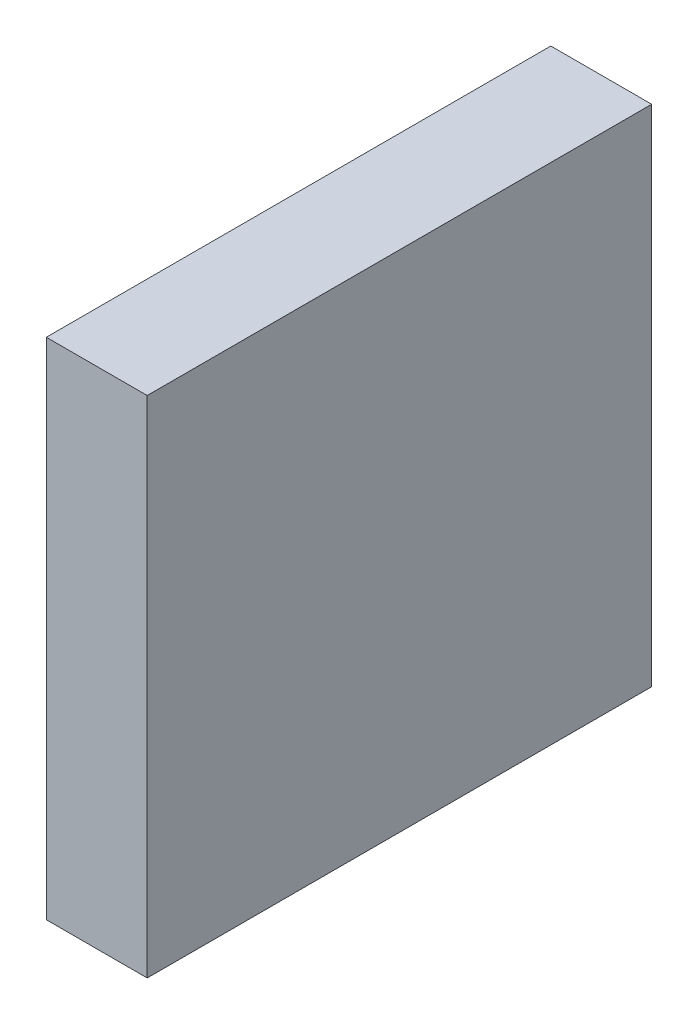
ISO-10303-21;
HEADER;
FILE_DESCRIPTION(('STEP AP214'),'2;1');
FILE_NAME('part.step','',(''),(''),'','','');
FILE_SCHEMA(('AUTOMOTIVE_DESIGN { 1 0 10303 214 1 1 1 1 }'));
ENDSEC;
DATA;
#1=APPLICATION_CONTEXT('core data for automotive mechanical design processes');
#2=APPLICATION_PROTOCOL_DEFINITION('international standard','automotive_design',2000,#1);
#3=PRODUCT_CONTEXT('',#1,'mechanical');
#4=PRODUCT('Part','Part','',(#3));
#5=PRODUCT_RELATED_PRODUCT_CATEGORY('part','',(#4));
#6=PRODUCT_DEFINITION_FORMATION('','',#4);
#7=PRODUCT_DEFINITION_CONTEXT('part definition',#1,'design');
#8=PRODUCT_DEFINITION('design','',#6,#7);
#9=PRODUCT_DEFINITION_SHAPE('','',#8);
#10=(LENGTH_UNIT() NAMED_UNIT(*) SI_UNIT(.MILLI.,.METRE.));
#11=(NAMED_UNIT(*) PLANE_ANGLE_UNIT() SI_UNIT($,.RADIAN.));
#12=(NAMED_UNIT(*) SI_UNIT($,.STERADIAN.) SOLID_ANGLE_UNIT());
#13=UNCERTAINTY_MEASURE_WITH_UNIT(LENGTH_MEASURE(1.E-05),#10,'distance_accuracy_value','');
#14=(GEOMETRIC_REPRESENTATION_CONTEXT(3) GLOBAL_UNCERTAINTY_ASSIGNED_CONTEXT((#13)) GLOBAL_UNIT_ASSIGNED_CONTEXT((#10,
#11,#12)) REPRESENTATION_CONTEXT('',''));
#15=CARTESIAN_POINT('',(0.,0.,0.));
#16=DIRECTION('',(0.,0.,1.));
#17=DIRECTION('',(1.,0.,0.));
#18=AXIS2_PLACEMENT_3D('',#15,#16,#17);
#19=CARTESIAN_POINT('',(-16.0310837576449,60.2513502285003,60.));
#20=DIRECTION('',(-1.,0.,0.));
#21=DIRECTION('',(0.,-1.,0.));
#22=AXIS2_PLACEMENT_3D('',#19,#20,#21);
#23=PLANE('',#22);
#24=DIRECTION('',(0.,1.,0.));
#25=VECTOR('',#24,1.);
#26=CARTESIAN_POINT('',(-16.0310837576449,60.2513502285003,0.));
#27=LINE('',#26,#25);
#28=CARTESIAN_POINT('',(-16.0310837576449,0.251350228500251,0.));
#29=VERTEX_POINT('',#28);
#30=CARTESIAN_POINT('',(-16.0310837576449,60.2513502285003,0.));
#31=VERTEX_POINT('',#30);
#32=EDGE_CURVE('E96',#29,#31,#27,.T.);
#33=ORIENTED_EDGE('',*,*,#32,.T.);
#34=DIRECTION('',(0.,0.,-1.));
#35=VECTOR('',#34,1.);
#36=CARTESIAN_POINT('',(-16.0310837576449,60.2513502285003,60.));
#37=LINE('',#36,#35);
#38=CARTESIAN_POINT('',(-16.0310837576449,60.2513502285003,60.));
#39=VERTEX_POINT('',#38);
#40=EDGE_CURVE('E11',#39,#31,#37,.T.);
#41=ORIENTED_EDGE('',*,*,#40,.F.);
#42=DIRECTION('',(0.,1.,0.));
#43=VECTOR('',#42,1.);
#44=CARTESIAN_POINT('',(-16.0310837576449,60.2513502285003,60.));
#45=LINE('',#44,#43);
#46=CARTESIAN_POINT('',(-16.0310837576449,0.251350228500251,60.));
#47=VERTEX_POINT('',#46);
#48=EDGE_CURVE('E84',#47,#39,#45,.T.);
#49=ORIENTED_EDGE('',*,*,#48,.F.);
#50=DIRECTION('',(0.,0.,-1.));
#51=VECTOR('',#50,1.);
#52=CARTESIAN_POINT('',(-16.0310837576449,0.251350228500251,60.));
#53=LINE('',#52,#51);
#54=EDGE_CURVE('E92',#47,#29,#53,.T.);
#55=ORIENTED_EDGE('',*,*,#54,.T.);
#56=EDGE_LOOP('',(#33,#41,#49,#55));
#57=FACE_BOUND('',#56,.T.);
#58=ADVANCED_FACE('F33',(#57),#23,.F.);
#59=CARTESIAN_POINT('',(-28.0310837576449,60.2513502285003,60.));
#60=DIRECTION('',(0.,-1.,0.));
#61=DIRECTION('',(0.,0.,-1.));
#62=AXIS2_PLACEMENT_3D('',#59,#60,#61);
#63=PLANE('',#62);
#64=DIRECTION('',(-1.,0.,0.));
#65=VECTOR('',#64,1.);
#66=CARTESIAN_POINT('',(-28.0310837576449,60.2513502285003,0.));
#67=LINE('',#66,#65);
#68=CARTESIAN_POINT('',(-28.0310837576449,60.2513502285003,0.));
#69=VERTEX_POINT('',#68);
#70=EDGE_CURVE('E88',#31,#69,#67,.T.);
#71=ORIENTED_EDGE('',*,*,#70,.T.);
#72=DIRECTION('',(0.,0.,-1.));
#73=VECTOR('',#72,1.);
#74=CARTESIAN_POINT('',(-28.0310837576449,60.2513502285003,60.));
#75=LINE('',#74,#73);
#76=CARTESIAN_POINT('',(-28.0310837576449,60.2513502285003,60.));
#77=VERTEX_POINT('',#76);
#78=EDGE_CURVE('E41',#77,#69,#75,.T.);
#79=ORIENTED_EDGE('',*,*,#78,.F.);
#80=DIRECTION('',(-1.,0.,0.));
#81=VECTOR('',#80,1.);
#82=CARTESIAN_POINT('',(-28.0310837576449,60.2513502285003,60.));
#83=LINE('',#82,#81);
#84=EDGE_CURVE('E79',#39,#77,#83,.T.);
#85=ORIENTED_EDGE('',*,*,#84,.F.);
#86=ORIENTED_EDGE('',*,*,#40,.T.);
#87=EDGE_LOOP('',(#71,#79,#85,#86));
#88=FACE_BOUND('',#87,.T.);
#89=ADVANCED_FACE('F87',(#88),#63,.F.);
#90=CARTESIAN_POINT('',(-28.0310837576449,60.2513502285003,60.));
#91=DIRECTION('',(1.,0.,0.));
#92=DIRECTION('',(0.,1.,0.));
#93=AXIS2_PLACEMENT_3D('',#90,#91,#92);
#94=PLANE('',#93);
#95=DIRECTION('',(0.,-1.,0.));
#96=VECTOR('',#95,1.);
#97=CARTESIAN_POINT('',(-28.0310837576449,60.2513502285003,0.));
#98=LINE('',#97,#96);
#99=CARTESIAN_POINT('',(-28.0310837576448,0.251350228500251,0.));
#100=VERTEX_POINT('',#99);
#101=EDGE_CURVE('E66',#69,#100,#98,.T.);
#102=ORIENTED_EDGE('',*,*,#101,.T.);
#103=DIRECTION('',(0.,0.,-1.));
#104=VECTOR('',#103,1.);
#105=CARTESIAN_POINT('',(-28.0310837576448,0.251350228500251,60.));
#106=LINE('',#105,#104);
#107=CARTESIAN_POINT('',(-28.0310837576448,0.251350228500251,60.));
#108=VERTEX_POINT('',#107);
#109=EDGE_CURVE('E89',#108,#100,#106,.T.);
#110=ORIENTED_EDGE('',*,*,#109,.F.);
#111=DIRECTION('',(0.,-1.,0.));
#112=VECTOR('',#111,1.);
#113=CARTESIAN_POINT('',(-28.0310837576449,60.2513502285003,60.));
#114=LINE('',#113,#112);
#115=EDGE_CURVE('E82',#77,#108,#114,.T.);
#116=ORIENTED_EDGE('',*,*,#115,.F.);
#117=ORIENTED_EDGE('',*,*,#78,.T.);
#118=EDGE_LOOP('',(#102,#110,#116,#117));
#119=FACE_BOUND('',#118,.T.);
#120=ADVANCED_FACE('F90',(#119),#94,.F.);
#121=CARTESIAN_POINT('',(-28.0310837576448,0.251350228500251,60.));
#122=DIRECTION('',(0.,1.,0.));
#123=DIRECTION('',(0.,0.,1.));
#124=AXIS2_PLACEMENT_3D('',#121,#122,#123);
#125=PLANE('',#124);
#126=DIRECTION('',(1.,0.,0.));
#127=VECTOR('',#126,1.);
#128=CARTESIAN_POINT('',(-28.0310837576448,0.251350228500251,0.));
#129=LINE('',#128,#127);
#130=EDGE_CURVE('E72',#100,#29,#129,.T.);
#131=ORIENTED_EDGE('',*,*,#130,.T.);
#132=ORIENTED_EDGE('',*,*,#54,.F.);
#133=DIRECTION('',(1.,0.,0.));
#134=VECTOR('',#133,1.);
#135=CARTESIAN_POINT('',(-28.0310837576448,0.251350228500251,60.));
#136=LINE('',#135,#134);
#137=EDGE_CURVE('E49',#108,#47,#136,.T.);
#138=ORIENTED_EDGE('',*,*,#137,.F.);
#139=ORIENTED_EDGE('',*,*,#109,.T.);
#140=EDGE_LOOP('',(#131,#132,#138,#139));
#141=FACE_BOUND('',#140,.T.);
#142=ADVANCED_FACE('F103',(#141),#125,.F.);
#143=CARTESIAN_POINT('',(0.,0.,60.));
#144=DIRECTION('',(0.,0.,1.));
#145=DIRECTION('',(1.,0.,0.));
#146=AXIS2_PLACEMENT_3D('',#143,#144,#145);
#147=PLANE('',#146);
#148=ORIENTED_EDGE('',*,*,#48,.T.);
#149=ORIENTED_EDGE('',*,*,#84,.T.);
#150=ORIENTED_EDGE('',*,*,#115,.T.);
#151=ORIENTED_EDGE('',*,*,#137,.T.);
#152=EDGE_LOOP('',(#148,#149,#150,#151));
#153=FACE_BOUND('',#152,.T.);
#154=ADVANCED_FACE('F80',(#153),#147,.T.);
#155=CARTESIAN_POINT('',(0.,0.,0.));
#156=DIRECTION('',(0.,0.,1.));
#157=DIRECTION('',(1.,0.,0.));
#158=AXIS2_PLACEMENT_3D('',#155,#156,#157);
#159=PLANE('',#158);
#160=ORIENTED_EDGE('',*,*,#32,.F.);
#161=ORIENTED_EDGE('',*,*,#130,.F.);
#162=ORIENTED_EDGE('',*,*,#101,.F.);
#163=ORIENTED_EDGE('',*,*,#70,.F.);
#164=EDGE_LOOP('',(#160,#161,#162,#163));
#165=FACE_BOUND('',#164,.T.);
#166=ADVANCED_FACE('F106',(#165),#159,.F.);
#167=CLOSED_SHELL('',(#58,#89,#120,#142,#154,#166));
#168=MANIFOLD_SOLID_BREP('B2',#167);
#169=ADVANCED_BREP_SHAPE_REPRESENTATION('',(#18,#168),#14);
#170=SHAPE_DEFINITION_REPRESENTATION(#9,#169);
ENDSEC;
END-ISO-10303-21;
